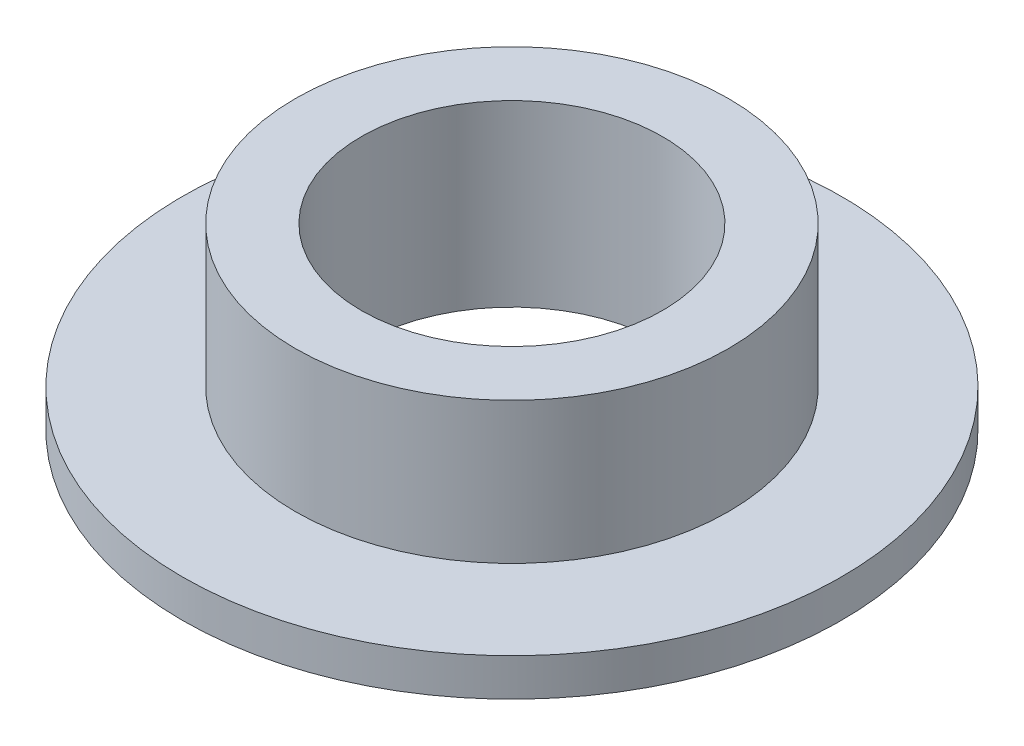
ISO-10303-21;
HEADER;
FILE_DESCRIPTION(('STEP AP214'),'2;1');
FILE_NAME('part.step','',(''),(''),'','','');
FILE_SCHEMA(('AUTOMOTIVE_DESIGN { 1 0 10303 214 1 1 1 1 }'));
ENDSEC;
DATA;
#1=APPLICATION_CONTEXT('core data for automotive mechanical design processes');
#2=APPLICATION_PROTOCOL_DEFINITION('international standard','automotive_design',2000,#1);
#3=PRODUCT_CONTEXT('',#1,'mechanical');
#4=PRODUCT('Part','Part','',(#3));
#5=PRODUCT_RELATED_PRODUCT_CATEGORY('part','',(#4));
#6=PRODUCT_DEFINITION_FORMATION('','',#4);
#7=PRODUCT_DEFINITION_CONTEXT('part definition',#1,'design');
#8=PRODUCT_DEFINITION('design','',#6,#7);
#9=PRODUCT_DEFINITION_SHAPE('','',#8);
#10=(LENGTH_UNIT() NAMED_UNIT(*) SI_UNIT(.MILLI.,.METRE.));
#11=(NAMED_UNIT(*) PLANE_ANGLE_UNIT() SI_UNIT($,.RADIAN.));
#12=(NAMED_UNIT(*) SI_UNIT($,.STERADIAN.) SOLID_ANGLE_UNIT());
#13=UNCERTAINTY_MEASURE_WITH_UNIT(LENGTH_MEASURE(1.E-05),#10,'distance_accuracy_value','');
#14=(GEOMETRIC_REPRESENTATION_CONTEXT(3) GLOBAL_UNCERTAINTY_ASSIGNED_CONTEXT((#13)) GLOBAL_UNIT_ASSIGNED_CONTEXT((#10,
#11,#12)) REPRESENTATION_CONTEXT('',''));
#15=CARTESIAN_POINT('',(0.,0.,0.));
#16=DIRECTION('',(0.,0.,1.));
#17=DIRECTION('',(1.,0.,0.));
#18=AXIS2_PLACEMENT_3D('',#15,#16,#17);
#19=CARTESIAN_POINT('',(0.,0.4,0.));
#20=DIRECTION('',(0.,-1.,0.));
#21=DIRECTION('',(0.,0.,-1.));
#22=AXIS2_PLACEMENT_3D('',#19,#20,#21);
#23=CYLINDRICAL_SURFACE('',#22,3.5);
#24=CARTESIAN_POINT('',(0.,0.4,0.));
#25=DIRECTION('',(0.,1.,0.));
#26=DIRECTION('',(0.,0.,1.));
#27=AXIS2_PLACEMENT_3D('',#24,#25,#26);
#28=CIRCLE('',#27,3.5);
#29=CARTESIAN_POINT('',(0.,0.4,3.5));
#30=VERTEX_POINT('',#29);
#31=EDGE_CURVE('E42',#30,#30,#28,.T.);
#32=ORIENTED_EDGE('',*,*,#31,.F.);
#33=EDGE_LOOP('',(#32));
#34=FACE_BOUND('',#33,.T.);
#35=CARTESIAN_POINT('',(0.,0.,0.));
#36=DIRECTION('',(0.,1.,0.));
#37=DIRECTION('',(0.,0.,1.));
#38=AXIS2_PLACEMENT_3D('',#35,#36,#37);
#39=CIRCLE('',#38,3.5);
#40=CARTESIAN_POINT('',(0.,0.,3.5));
#41=VERTEX_POINT('',#40);
#42=EDGE_CURVE('E38',#41,#41,#39,.T.);
#43=ORIENTED_EDGE('',*,*,#42,.T.);
#44=EDGE_LOOP('',(#43));
#45=FACE_BOUND('',#44,.T.);
#46=ADVANCED_FACE('F35',(#34,#45),#23,.T.);
#47=CARTESIAN_POINT('',(0.,0.4,0.));
#48=DIRECTION('',(0.,1.,0.));
#49=DIRECTION('',(0.,0.,1.));
#50=AXIS2_PLACEMENT_3D('',#47,#48,#49);
#51=PLANE('',#50);
#52=CARTESIAN_POINT('',(0.,0.4,0.));
#53=DIRECTION('',(0.,1.,0.));
#54=DIRECTION('',(0.,0.,1.));
#55=AXIS2_PLACEMENT_3D('',#52,#53,#54);
#56=CIRCLE('',#55,2.3);
#57=CARTESIAN_POINT('',(0.,0.4,2.3));
#58=VERTEX_POINT('',#57);
#59=EDGE_CURVE('E10',#58,#58,#56,.T.);
#60=ORIENTED_EDGE('',*,*,#59,.F.);
#61=EDGE_LOOP('',(#60));
#62=FACE_BOUND('',#61,.T.);
#63=ORIENTED_EDGE('',*,*,#31,.T.);
#64=EDGE_LOOP('',(#63));
#65=FACE_BOUND('',#64,.T.);
#66=ADVANCED_FACE('F74',(#62,#65),#51,.T.);
#67=CARTESIAN_POINT('',(0.,0.,0.));
#68=DIRECTION('',(0.,1.,0.));
#69=DIRECTION('',(0.,0.,1.));
#70=AXIS2_PLACEMENT_3D('',#67,#68,#69);
#71=PLANE('',#70);
#72=CARTESIAN_POINT('',(0.,0.,0.));
#73=DIRECTION('',(0.,1.,0.));
#74=DIRECTION('',(0.,0.,1.));
#75=AXIS2_PLACEMENT_3D('',#72,#73,#74);
#76=CIRCLE('',#75,1.6);
#77=CARTESIAN_POINT('',(0.,0.,1.6));
#78=VERTEX_POINT('',#77);
#79=EDGE_CURVE('E51',#78,#78,#76,.T.);
#80=ORIENTED_EDGE('',*,*,#79,.T.);
#81=EDGE_LOOP('',(#80));
#82=FACE_BOUND('',#81,.T.);
#83=ORIENTED_EDGE('',*,*,#42,.F.);
#84=EDGE_LOOP('',(#83));
#85=FACE_BOUND('',#84,.T.);
#86=ADVANCED_FACE('F69',(#82,#85),#71,.F.);
#87=CARTESIAN_POINT('',(0.,1.9,0.));
#88=DIRECTION('',(0.,-1.,0.));
#89=DIRECTION('',(0.,0.,-1.));
#90=AXIS2_PLACEMENT_3D('',#87,#88,#89);
#91=CYLINDRICAL_SURFACE('',#90,2.3);
#92=CARTESIAN_POINT('',(0.,1.9,0.));
#93=DIRECTION('',(0.,1.,0.));
#94=DIRECTION('',(0.,0.,1.));
#95=AXIS2_PLACEMENT_3D('',#92,#93,#94);
#96=CIRCLE('',#95,2.3);
#97=CARTESIAN_POINT('',(0.,1.9,2.3));
#98=VERTEX_POINT('',#97);
#99=EDGE_CURVE('E48',#98,#98,#96,.T.);
#100=ORIENTED_EDGE('',*,*,#99,.F.);
#101=EDGE_LOOP('',(#100));
#102=FACE_BOUND('',#101,.T.);
#103=ORIENTED_EDGE('',*,*,#59,.T.);
#104=EDGE_LOOP('',(#103));
#105=FACE_BOUND('',#104,.T.);
#106=ADVANCED_FACE('F64',(#102,#105),#91,.T.);
#107=CARTESIAN_POINT('',(0.,1.9,0.));
#108=DIRECTION('',(0.,1.,0.));
#109=DIRECTION('',(0.,0.,1.));
#110=AXIS2_PLACEMENT_3D('',#107,#108,#109);
#111=PLANE('',#110);
#112=CARTESIAN_POINT('',(0.,1.9,0.));
#113=DIRECTION('',(0.,1.,0.));
#114=DIRECTION('',(0.,0.,1.));
#115=AXIS2_PLACEMENT_3D('',#112,#113,#114);
#116=CIRCLE('',#115,1.6);
#117=CARTESIAN_POINT('',(0.,1.9,1.6));
#118=VERTEX_POINT('',#117);
#119=EDGE_CURVE('E54',#118,#118,#116,.T.);
#120=ORIENTED_EDGE('',*,*,#119,.F.);
#121=EDGE_LOOP('',(#120));
#122=FACE_BOUND('',#121,.T.);
#123=ORIENTED_EDGE('',*,*,#99,.T.);
#124=EDGE_LOOP('',(#123));
#125=FACE_BOUND('',#124,.T.);
#126=ADVANCED_FACE('F61',(#122,#125),#111,.T.);
#127=CARTESIAN_POINT('',(0.,-14.1,0.));
#128=DIRECTION('',(0.,1.,0.));
#129=DIRECTION('',(0.,0.,1.));
#130=AXIS2_PLACEMENT_3D('',#127,#128,#129);
#131=CYLINDRICAL_SURFACE('',#130,1.6);
#132=ORIENTED_EDGE('',*,*,#119,.T.);
#133=EDGE_LOOP('',(#132));
#134=FACE_BOUND('',#133,.T.);
#135=ORIENTED_EDGE('',*,*,#79,.F.);
#136=EDGE_LOOP('',(#135));
#137=FACE_BOUND('',#136,.T.);
#138=ADVANCED_FACE('F58',(#134,#137),#131,.F.);
#139=CLOSED_SHELL('',(#46,#66,#86,#106,#126,#138));
#140=MANIFOLD_SOLID_BREP('B2',#139);
#141=ADVANCED_BREP_SHAPE_REPRESENTATION('',(#18,#140),#14);
#142=SHAPE_DEFINITION_REPRESENTATION(#9,#141);
ENDSEC;
END-ISO-10303-21;
